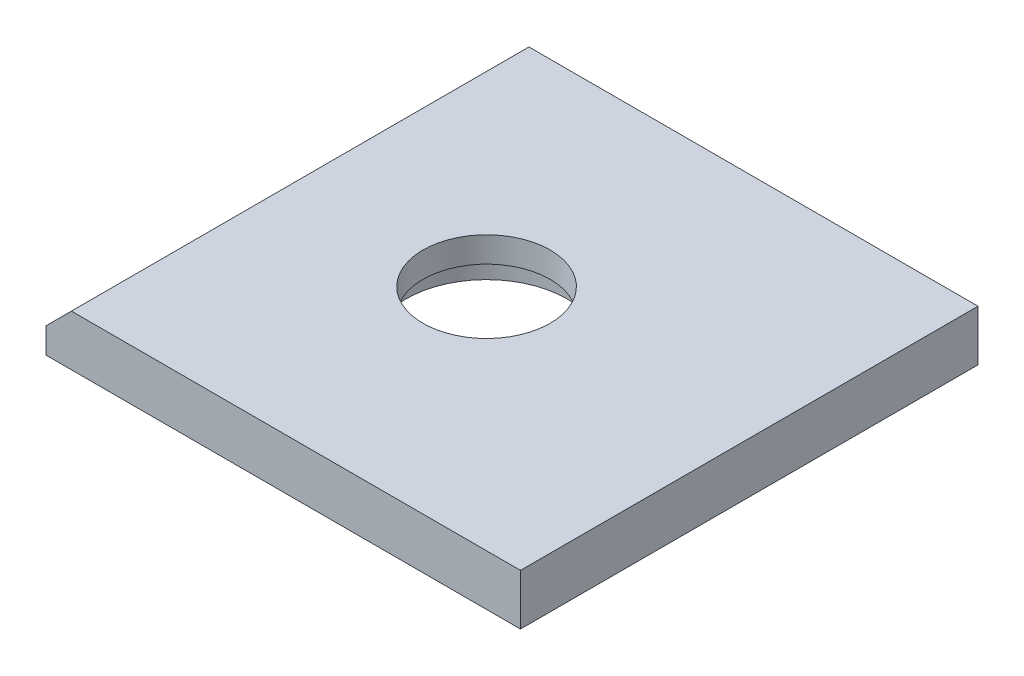
ISO-10303-21;
HEADER;
FILE_DESCRIPTION(('STEP AP214'),'2;1');
FILE_NAME('part.step','',(''),(''),'','','');
FILE_SCHEMA(('AUTOMOTIVE_DESIGN { 1 0 10303 214 1 1 1 1 }'));
ENDSEC;
DATA;
#1=APPLICATION_CONTEXT('core data for automotive mechanical design processes');
#2=APPLICATION_PROTOCOL_DEFINITION('international standard','automotive_design',2000,#1);
#3=PRODUCT_CONTEXT('',#1,'mechanical');
#4=PRODUCT('Part','Part','',(#3));
#5=PRODUCT_RELATED_PRODUCT_CATEGORY('part','',(#4));
#6=PRODUCT_DEFINITION_FORMATION('','',#4);
#7=PRODUCT_DEFINITION_CONTEXT('part definition',#1,'design');
#8=PRODUCT_DEFINITION('design','',#6,#7);
#9=PRODUCT_DEFINITION_SHAPE('','',#8);
#10=(LENGTH_UNIT() NAMED_UNIT(*) SI_UNIT(.MILLI.,.METRE.));
#11=(NAMED_UNIT(*) PLANE_ANGLE_UNIT() SI_UNIT($,.RADIAN.));
#12=(NAMED_UNIT(*) SI_UNIT($,.STERADIAN.) SOLID_ANGLE_UNIT());
#13=UNCERTAINTY_MEASURE_WITH_UNIT(LENGTH_MEASURE(1.E-05),#10,'distance_accuracy_value','');
#14=(GEOMETRIC_REPRESENTATION_CONTEXT(3) GLOBAL_UNCERTAINTY_ASSIGNED_CONTEXT((#13)) GLOBAL_UNIT_ASSIGNED_CONTEXT((#10,
#11,#12)) REPRESENTATION_CONTEXT('',''));
#15=CARTESIAN_POINT('',(0.,0.,0.));
#16=DIRECTION('',(0.,0.,1.));
#17=DIRECTION('',(1.,0.,0.));
#18=AXIS2_PLACEMENT_3D('',#15,#16,#17);
#19=CARTESIAN_POINT('',(-3.,2.99999999999989,0.));
#20=DIRECTION('',(0.,-1.,0.));
#21=DIRECTION('',(0.,0.,-1.));
#22=AXIS2_PLACEMENT_3D('',#19,#20,#21);
#23=CYLINDRICAL_SURFACE('',#22,7.5);
#24=CARTESIAN_POINT('',(-3.,2.99999999999989,0.));
#25=DIRECTION('',(0.,-1.,0.));
#26=DIRECTION('',(0.,0.,-1.));
#27=AXIS2_PLACEMENT_3D('',#24,#25,#26);
#28=CIRCLE('',#27,7.5);
#29=CARTESIAN_POINT('',(-3.,2.99999999999989,-7.5));
#30=VERTEX_POINT('',#29);
#31=EDGE_CURVE('E77',#30,#30,#28,.F.);
#32=ORIENTED_EDGE('',*,*,#31,.F.);
#33=EDGE_LOOP('',(#32));
#34=FACE_BOUND('',#33,.T.);
#35=CARTESIAN_POINT('',(-3.,5.99999999999989,0.));
#36=DIRECTION('',(0.,-1.,0.));
#37=DIRECTION('',(0.,0.,-1.));
#38=AXIS2_PLACEMENT_3D('',#35,#36,#37);
#39=CIRCLE('',#38,7.5);
#40=CARTESIAN_POINT('',(-3.,5.99999999999989,-7.5));
#41=VERTEX_POINT('',#40);
#42=EDGE_CURVE('E19',#41,#41,#39,.T.);
#43=ORIENTED_EDGE('',*,*,#42,.F.);
#44=EDGE_LOOP('',(#43));
#45=FACE_BOUND('',#44,.T.);
#46=ADVANCED_FACE('F16',(#34,#45),#23,.F.);
#47=CARTESIAN_POINT('',(0.,5.99999999999989,0.));
#48=DIRECTION('',(0.,1.,0.));
#49=DIRECTION('',(0.,0.,1.));
#50=AXIS2_PLACEMENT_3D('',#47,#48,#49);
#51=PLANE('',#50);
#52=ORIENTED_EDGE('',*,*,#42,.T.);
#53=EDGE_LOOP('',(#52));
#54=FACE_BOUND('',#53,.T.);
#55=DIRECTION('',(-1.,0.,0.));
#56=VECTOR('',#55,1.);
#57=CARTESIAN_POINT('',(28.,5.99999999999989,-27.));
#58=LINE('',#57,#56);
#59=CARTESIAN_POINT('',(-25.,5.99999999999989,-27.));
#60=VERTEX_POINT('',#59);
#61=CARTESIAN_POINT('',(28.,5.99999999999989,-27.));
#62=VERTEX_POINT('',#61);
#63=EDGE_CURVE('E110',#60,#62,#58,.F.);
#64=ORIENTED_EDGE('',*,*,#63,.F.);
#65=DIRECTION('',(0.,0.,1.));
#66=VECTOR('',#65,1.);
#67=CARTESIAN_POINT('',(-25.,5.99999999999989,0.));
#68=LINE('',#67,#66);
#69=CARTESIAN_POINT('',(-25.,6.,27.));
#70=VERTEX_POINT('',#69);
#71=EDGE_CURVE('E90',#70,#60,#68,.F.);
#72=ORIENTED_EDGE('',*,*,#71,.F.);
#73=DIRECTION('',(1.,0.,0.));
#74=VECTOR('',#73,1.);
#75=CARTESIAN_POINT('',(-28.,6.,27.));
#76=LINE('',#75,#74);
#77=CARTESIAN_POINT('',(28.,6.,27.));
#78=VERTEX_POINT('',#77);
#79=EDGE_CURVE('E61',#78,#70,#76,.F.);
#80=ORIENTED_EDGE('',*,*,#79,.F.);
#81=DIRECTION('',(0.,0.,-1.));
#82=VECTOR('',#81,1.);
#83=CARTESIAN_POINT('',(28.,6.,27.));
#84=LINE('',#83,#82);
#85=EDGE_CURVE('E82',#62,#78,#84,.F.);
#86=ORIENTED_EDGE('',*,*,#85,.F.);
#87=EDGE_LOOP('',(#64,#72,#80,#86));
#88=FACE_BOUND('',#87,.T.);
#89=ADVANCED_FACE('F102',(#54,#88),#51,.T.);
#90=CARTESIAN_POINT('',(-26.5,4.49999999999989,0.));
#91=DIRECTION('',(-0.707106781186548,0.707106781186548,0.));
#92=DIRECTION('',(-0.707106781186548,-0.707106781186548,0.));
#93=AXIS2_PLACEMENT_3D('',#90,#91,#92);
#94=PLANE('',#93);
#95=DIRECTION('',(0.,0.,1.));
#96=VECTOR('',#95,1.);
#97=CARTESIAN_POINT('',(-28.,2.99999999999989,-27.));
#98=LINE('',#97,#96);
#99=CARTESIAN_POINT('',(-28.,3.,27.));
#100=VERTEX_POINT('',#99);
#101=CARTESIAN_POINT('',(-28.,2.99999999999989,-27.));
#102=VERTEX_POINT('',#101);
#103=EDGE_CURVE('E67',#100,#102,#98,.F.);
#104=ORIENTED_EDGE('',*,*,#103,.F.);
#105=DIRECTION('',(-0.707106781186547,-0.707106781186548,0.));
#106=VECTOR('',#105,1.);
#107=CARTESIAN_POINT('',(-25.,6.,27.));
#108=LINE('',#107,#106);
#109=EDGE_CURVE('E69',#70,#100,#108,.T.);
#110=ORIENTED_EDGE('',*,*,#109,.F.);
#111=ORIENTED_EDGE('',*,*,#71,.T.);
#112=DIRECTION('',(0.707106781186547,0.707106781186548,0.));
#113=VECTOR('',#112,1.);
#114=CARTESIAN_POINT('',(-28.,2.99999999999989,-27.));
#115=LINE('',#114,#113);
#116=EDGE_CURVE('E71',#102,#60,#115,.T.);
#117=ORIENTED_EDGE('',*,*,#116,.F.);
#118=EDGE_LOOP('',(#104,#110,#111,#117));
#119=FACE_BOUND('',#118,.T.);
#120=ADVANCED_FACE('F68',(#119),#94,.T.);
#121=CARTESIAN_POINT('',(28.,3.,-95.));
#122=DIRECTION('',(0.,-1.,0.));
#123=DIRECTION('',(0.,0.,-1.));
#124=AXIS2_PLACEMENT_3D('',#121,#122,#123);
#125=PLANE('',#124);
#126=ORIENTED_EDGE('',*,*,#31,.T.);
#127=EDGE_LOOP('',(#126));
#128=FACE_BOUND('',#127,.T.);
#129=CARTESIAN_POINT('',(-3.,2.99999999999989,0.));
#130=DIRECTION('',(0.,-1.,0.));
#131=DIRECTION('',(0.,0.,-1.));
#132=AXIS2_PLACEMENT_3D('',#129,#130,#131);
#133=CIRCLE('',#132,9.5);
#134=CARTESIAN_POINT('',(-3.,2.99999999999989,-9.5));
#135=VERTEX_POINT('',#134);
#136=EDGE_CURVE('E92',#135,#135,#133,.T.);
#137=ORIENTED_EDGE('',*,*,#136,.T.);
#138=EDGE_LOOP('',(#137));
#139=FACE_BOUND('',#138,.T.);
#140=ADVANCED_FACE('F97',(#128,#139),#125,.T.);
#141=CARTESIAN_POINT('',(-28.,0.,-27.));
#142=DIRECTION('',(-1.,0.,0.));
#143=DIRECTION('',(0.,0.,1.));
#144=AXIS2_PLACEMENT_3D('',#141,#142,#143);
#145=PLANE('',#144);
#146=DIRECTION('',(0.,1.,0.));
#147=VECTOR('',#146,1.);
#148=CARTESIAN_POINT('',(-28.,0.,27.0000000000001));
#149=LINE('',#148,#147);
#150=CARTESIAN_POINT('',(-28.,0.,27.0000000000001));
#151=VERTEX_POINT('',#150);
#152=EDGE_CURVE('E76',#100,#151,#149,.F.);
#153=ORIENTED_EDGE('',*,*,#152,.F.);
#154=ORIENTED_EDGE('',*,*,#103,.T.);
#155=DIRECTION('',(0.,1.,0.));
#156=VECTOR('',#155,1.);
#157=CARTESIAN_POINT('',(-28.,0.,-27.));
#158=LINE('',#157,#156);
#159=CARTESIAN_POINT('',(-28.,0.,-27.));
#160=VERTEX_POINT('',#159);
#161=EDGE_CURVE('E113',#160,#102,#158,.T.);
#162=ORIENTED_EDGE('',*,*,#161,.F.);
#163=DIRECTION('',(0.,0.,1.));
#164=VECTOR('',#163,1.);
#165=CARTESIAN_POINT('',(-28.,0.,0.));
#166=LINE('',#165,#164);
#167=EDGE_CURVE('E86',#160,#151,#166,.T.);
#168=ORIENTED_EDGE('',*,*,#167,.T.);
#169=EDGE_LOOP('',(#153,#154,#162,#168));
#170=FACE_BOUND('',#169,.T.);
#171=ADVANCED_FACE('F85',(#170),#145,.T.);
#172=CARTESIAN_POINT('',(-28.,0.,27.0000000000001));
#173=DIRECTION('',(0.,0.,1.));
#174=DIRECTION('',(1.,0.,0.));
#175=AXIS2_PLACEMENT_3D('',#172,#173,#174);
#176=PLANE('',#175);
#177=ORIENTED_EDGE('',*,*,#79,.T.);
#178=ORIENTED_EDGE('',*,*,#109,.T.);
#179=ORIENTED_EDGE('',*,*,#152,.T.);
#180=DIRECTION('',(1.,0.,0.));
#181=VECTOR('',#180,1.);
#182=CARTESIAN_POINT('',(0.,0.,27.0000000000001));
#183=LINE('',#182,#181);
#184=CARTESIAN_POINT('',(28.,0.,27.0000000000001));
#185=VERTEX_POINT('',#184);
#186=EDGE_CURVE('E122',#151,#185,#183,.T.);
#187=ORIENTED_EDGE('',*,*,#186,.T.);
#188=DIRECTION('',(0.,1.,0.));
#189=VECTOR('',#188,1.);
#190=CARTESIAN_POINT('',(28.,0.,27.0000000000001));
#191=LINE('',#190,#189);
#192=EDGE_CURVE('E111',#78,#185,#191,.F.);
#193=ORIENTED_EDGE('',*,*,#192,.F.);
#194=EDGE_LOOP('',(#177,#178,#179,#187,#193));
#195=FACE_BOUND('',#194,.T.);
#196=ADVANCED_FACE('F79',(#195),#176,.T.);
#197=CARTESIAN_POINT('',(28.,0.,27.0000000000001));
#198=DIRECTION('',(1.,0.,0.));
#199=DIRECTION('',(0.,0.,-1.));
#200=AXIS2_PLACEMENT_3D('',#197,#198,#199);
#201=PLANE('',#200);
#202=ORIENTED_EDGE('',*,*,#192,.T.);
#203=DIRECTION('',(0.,0.,1.));
#204=VECTOR('',#203,1.);
#205=CARTESIAN_POINT('',(28.,0.,0.));
#206=LINE('',#205,#204);
#207=CARTESIAN_POINT('',(28.,0.,-27.));
#208=VERTEX_POINT('',#207);
#209=EDGE_CURVE('E124',#185,#208,#206,.F.);
#210=ORIENTED_EDGE('',*,*,#209,.T.);
#211=DIRECTION('',(0.,1.,0.));
#212=VECTOR('',#211,1.);
#213=CARTESIAN_POINT('',(28.,0.,-27.));
#214=LINE('',#213,#212);
#215=EDGE_CURVE('E34',#62,#208,#214,.F.);
#216=ORIENTED_EDGE('',*,*,#215,.F.);
#217=ORIENTED_EDGE('',*,*,#85,.T.);
#218=EDGE_LOOP('',(#202,#210,#216,#217));
#219=FACE_BOUND('',#218,.T.);
#220=ADVANCED_FACE('F119',(#219),#201,.T.);
#221=CARTESIAN_POINT('',(28.,0.,-27.));
#222=DIRECTION('',(0.,0.,-1.));
#223=DIRECTION('',(-1.,0.,0.));
#224=AXIS2_PLACEMENT_3D('',#221,#222,#223);
#225=PLANE('',#224);
#226=ORIENTED_EDGE('',*,*,#161,.T.);
#227=ORIENTED_EDGE('',*,*,#116,.T.);
#228=ORIENTED_EDGE('',*,*,#63,.T.);
#229=ORIENTED_EDGE('',*,*,#215,.T.);
#230=DIRECTION('',(1.,0.,0.));
#231=VECTOR('',#230,1.);
#232=CARTESIAN_POINT('',(0.,0.,-27.));
#233=LINE('',#232,#231);
#234=EDGE_CURVE('E25',#208,#160,#233,.F.);
#235=ORIENTED_EDGE('',*,*,#234,.T.);
#236=EDGE_LOOP('',(#226,#227,#228,#229,#235));
#237=FACE_BOUND('',#236,.T.);
#238=ADVANCED_FACE('F130',(#237),#225,.T.);
#239=CARTESIAN_POINT('',(-3.,0.,0.));
#240=DIRECTION('',(0.,-1.,0.));
#241=DIRECTION('',(0.,0.,-1.));
#242=AXIS2_PLACEMENT_3D('',#239,#240,#241);
#243=CYLINDRICAL_SURFACE('',#242,9.5);
#244=ORIENTED_EDGE('',*,*,#136,.F.);
#245=EDGE_LOOP('',(#244));
#246=FACE_BOUND('',#245,.T.);
#247=CARTESIAN_POINT('',(-3.,0.,0.));
#248=DIRECTION('',(0.,-1.,0.));
#249=DIRECTION('',(0.,0.,-1.));
#250=AXIS2_PLACEMENT_3D('',#247,#248,#249);
#251=CIRCLE('',#250,9.5);
#252=CARTESIAN_POINT('',(-3.,0.,-9.5));
#253=VERTEX_POINT('',#252);
#254=EDGE_CURVE('E11',#253,#253,#251,.T.);
#255=ORIENTED_EDGE('',*,*,#254,.T.);
#256=EDGE_LOOP('',(#255));
#257=FACE_BOUND('',#256,.T.);
#258=ADVANCED_FACE('F133',(#246,#257),#243,.F.);
#259=CARTESIAN_POINT('',(0.,0.,0.));
#260=DIRECTION('',(0.,1.,0.));
#261=DIRECTION('',(0.,0.,1.));
#262=AXIS2_PLACEMENT_3D('',#259,#260,#261);
#263=PLANE('',#262);
#264=ORIENTED_EDGE('',*,*,#254,.F.);
#265=EDGE_LOOP('',(#264));
#266=FACE_BOUND('',#265,.T.);
#267=ORIENTED_EDGE('',*,*,#209,.F.);
#268=ORIENTED_EDGE('',*,*,#186,.F.);
#269=ORIENTED_EDGE('',*,*,#167,.F.);
#270=ORIENTED_EDGE('',*,*,#234,.F.);
#271=EDGE_LOOP('',(#267,#268,#269,#270));
#272=FACE_BOUND('',#271,.T.);
#273=ADVANCED_FACE('F131',(#266,#272),#263,.F.);
#274=CLOSED_SHELL('',(#46,#89,#120,#140,#171,#196,#220,#238,#258,#273));
#275=MANIFOLD_SOLID_BREP('B1',#274);
#276=ADVANCED_BREP_SHAPE_REPRESENTATION('',(#18,#275),#14);
#277=SHAPE_DEFINITION_REPRESENTATION(#9,#276);
ENDSEC;
END-ISO-10303-21;
